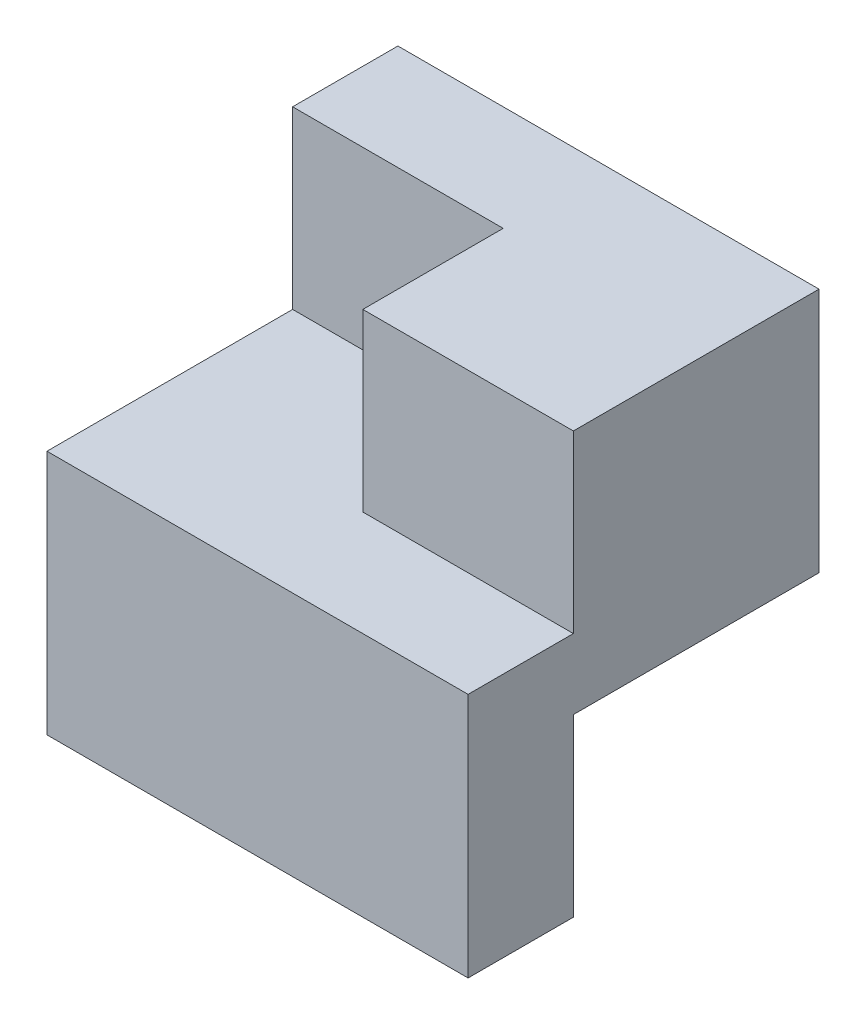
ISO-10303-21;
HEADER;
FILE_DESCRIPTION(('STEP AP214'),'2;1');
FILE_NAME('part.step','',(''),(''),'','','');
FILE_SCHEMA(('AUTOMOTIVE_DESIGN { 1 0 10303 214 1 1 1 1 }'));
ENDSEC;
DATA;
#1=APPLICATION_CONTEXT('core data for automotive mechanical design processes');
#2=APPLICATION_PROTOCOL_DEFINITION('international standard','automotive_design',2000,#1);
#3=PRODUCT_CONTEXT('',#1,'mechanical');
#4=PRODUCT('Part','Part','',(#3));
#5=PRODUCT_RELATED_PRODUCT_CATEGORY('part','',(#4));
#6=PRODUCT_DEFINITION_FORMATION('','',#4);
#7=PRODUCT_DEFINITION_CONTEXT('part definition',#1,'design');
#8=PRODUCT_DEFINITION('design','',#6,#7);
#9=PRODUCT_DEFINITION_SHAPE('','',#8);
#10=(LENGTH_UNIT() NAMED_UNIT(*) SI_UNIT(.MILLI.,.METRE.));
#11=(NAMED_UNIT(*) PLANE_ANGLE_UNIT() SI_UNIT($,.RADIAN.));
#12=(NAMED_UNIT(*) SI_UNIT($,.STERADIAN.) SOLID_ANGLE_UNIT());
#13=UNCERTAINTY_MEASURE_WITH_UNIT(LENGTH_MEASURE(1.E-05),#10,'distance_accuracy_value','');
#14=(GEOMETRIC_REPRESENTATION_CONTEXT(3) GLOBAL_UNCERTAINTY_ASSIGNED_CONTEXT((#13)) GLOBAL_UNIT_ASSIGNED_CONTEXT((#10,
#11,#12)) REPRESENTATION_CONTEXT('',''));
#15=CARTESIAN_POINT('',(0.,0.,0.));
#16=DIRECTION('',(0.,0.,1.));
#17=DIRECTION('',(1.,0.,0.));
#18=AXIS2_PLACEMENT_3D('',#15,#16,#17);
#19=CARTESIAN_POINT('',(-3.,6.,-2.5));
#20=DIRECTION('',(0.,0.,1.));
#21=DIRECTION('',(1.,0.,0.));
#22=AXIS2_PLACEMENT_3D('',#19,#20,#21);
#23=PLANE('',#22);
#24=DIRECTION('',(1.,0.,0.));
#25=VECTOR('',#24,1.);
#26=CARTESIAN_POINT('',(0.,2.5,-2.5));
#27=LINE('',#26,#25);
#28=CARTESIAN_POINT('',(-3.,2.5,-2.5));
#29=VERTEX_POINT('',#28);
#30=CARTESIAN_POINT('',(3.,2.5,-2.5));
#31=VERTEX_POINT('',#30);
#32=EDGE_CURVE('E149',#29,#31,#27,.T.);
#33=ORIENTED_EDGE('',*,*,#32,.F.);
#34=DIRECTION('',(0.,-1.,0.));
#35=VECTOR('',#34,1.);
#36=CARTESIAN_POINT('',(-3.,6.,-2.5));
#37=LINE('',#36,#35);
#38=CARTESIAN_POINT('',(-3.,6.,-2.5));
#39=VERTEX_POINT('',#38);
#40=EDGE_CURVE('E41',#39,#29,#37,.T.);
#41=ORIENTED_EDGE('',*,*,#40,.F.);
#42=DIRECTION('',(-1.,0.,0.));
#43=VECTOR('',#42,1.);
#44=CARTESIAN_POINT('',(-3.,6.,-2.5));
#45=LINE('',#44,#43);
#46=CARTESIAN_POINT('',(3.,6.,-2.5));
#47=VERTEX_POINT('',#46);
#48=EDGE_CURVE('E195',#47,#39,#45,.T.);
#49=ORIENTED_EDGE('',*,*,#48,.F.);
#50=DIRECTION('',(0.,-1.,0.));
#51=VECTOR('',#50,1.);
#52=CARTESIAN_POINT('',(3.,6.,-2.5));
#53=LINE('',#52,#51);
#54=EDGE_CURVE('E11',#47,#31,#53,.T.);
#55=ORIENTED_EDGE('',*,*,#54,.T.);
#56=EDGE_LOOP('',(#33,#41,#49,#55));
#57=FACE_BOUND('',#56,.T.);
#58=ADVANCED_FACE('F33',(#57),#23,.F.);
#59=CARTESIAN_POINT('',(-3.,6.,2.5));
#60=DIRECTION('',(0.,0.,-1.));
#61=DIRECTION('',(-1.,0.,0.));
#62=AXIS2_PLACEMENT_3D('',#59,#60,#61);
#63=PLANE('',#62);
#64=DIRECTION('',(1.,0.,0.));
#65=VECTOR('',#64,1.);
#66=CARTESIAN_POINT('',(-3.,3.5,2.5));
#67=LINE('',#66,#65);
#68=CARTESIAN_POINT('',(-3.,3.5,2.5));
#69=VERTEX_POINT('',#68);
#70=CARTESIAN_POINT('',(3.,3.5,2.5));
#71=VERTEX_POINT('',#70);
#72=EDGE_CURVE('E177',#69,#71,#67,.T.);
#73=ORIENTED_EDGE('',*,*,#72,.F.);
#74=DIRECTION('',(0.,-1.,0.));
#75=VECTOR('',#74,1.);
#76=CARTESIAN_POINT('',(-3.,6.,2.5));
#77=LINE('',#76,#75);
#78=CARTESIAN_POINT('',(-3.,0.,2.5));
#79=VERTEX_POINT('',#78);
#80=EDGE_CURVE('E209',#69,#79,#77,.T.);
#81=ORIENTED_EDGE('',*,*,#80,.T.);
#82=DIRECTION('',(1.,0.,0.));
#83=VECTOR('',#82,1.);
#84=CARTESIAN_POINT('',(-3.,0.,2.5));
#85=LINE('',#84,#83);
#86=CARTESIAN_POINT('',(3.,0.,2.5));
#87=VERTEX_POINT('',#86);
#88=EDGE_CURVE('E196',#79,#87,#85,.T.);
#89=ORIENTED_EDGE('',*,*,#88,.T.);
#90=DIRECTION('',(0.,-1.,0.));
#91=VECTOR('',#90,1.);
#92=CARTESIAN_POINT('',(3.,6.,2.5));
#93=LINE('',#92,#91);
#94=EDGE_CURVE('E201',#71,#87,#93,.T.);
#95=ORIENTED_EDGE('',*,*,#94,.F.);
#96=EDGE_LOOP('',(#73,#81,#89,#95));
#97=FACE_BOUND('',#96,.T.);
#98=ADVANCED_FACE('F236',(#97),#63,.F.);
#99=CARTESIAN_POINT('',(3.,6.,2.5));
#100=DIRECTION('',(-1.,0.,0.));
#101=DIRECTION('',(0.,0.,1.));
#102=AXIS2_PLACEMENT_3D('',#99,#100,#101);
#103=PLANE('',#102);
#104=DIRECTION('',(0.,0.,-1.));
#105=VECTOR('',#104,1.);
#106=CARTESIAN_POINT('',(3.,0.,2.5));
#107=LINE('',#106,#105);
#108=CARTESIAN_POINT('',(3.,0.,1.));
#109=VERTEX_POINT('',#108);
#110=EDGE_CURVE('E187',#87,#109,#107,.T.);
#111=ORIENTED_EDGE('',*,*,#110,.T.);
#112=DIRECTION('',(0.,-1.,0.));
#113=VECTOR('',#112,1.);
#114=CARTESIAN_POINT('',(3.,2.5,1.));
#115=LINE('',#114,#113);
#116=CARTESIAN_POINT('',(3.,2.5,1.));
#117=VERTEX_POINT('',#116);
#118=EDGE_CURVE('E159',#117,#109,#115,.T.);
#119=ORIENTED_EDGE('',*,*,#118,.F.);
#120=DIRECTION('',(0.,0.,1.));
#121=VECTOR('',#120,1.);
#122=CARTESIAN_POINT('',(3.,2.5,0.));
#123=LINE('',#122,#121);
#124=EDGE_CURVE('E151',#31,#117,#123,.T.);
#125=ORIENTED_EDGE('',*,*,#124,.F.);
#126=ORIENTED_EDGE('',*,*,#54,.F.);
#127=DIRECTION('',(0.,0.,-1.));
#128=VECTOR('',#127,1.);
#129=CARTESIAN_POINT('',(3.,6.,2.5));
#130=LINE('',#129,#128);
#131=CARTESIAN_POINT('',(3.,6.,1.));
#132=VERTEX_POINT('',#131);
#133=EDGE_CURVE('E193',#132,#47,#130,.T.);
#134=ORIENTED_EDGE('',*,*,#133,.F.);
#135=DIRECTION('',(0.,1.,0.));
#136=VECTOR('',#135,1.);
#137=CARTESIAN_POINT('',(3.,3.5,1.));
#138=LINE('',#137,#136);
#139=CARTESIAN_POINT('',(3.,3.5,1.));
#140=VERTEX_POINT('',#139);
#141=EDGE_CURVE('E56',#140,#132,#138,.T.);
#142=ORIENTED_EDGE('',*,*,#141,.F.);
#143=DIRECTION('',(0.,0.,-1.));
#144=VECTOR('',#143,1.);
#145=CARTESIAN_POINT('',(3.,3.5,2.5));
#146=LINE('',#145,#144);
#147=EDGE_CURVE('E162',#71,#140,#146,.T.);
#148=ORIENTED_EDGE('',*,*,#147,.F.);
#149=ORIENTED_EDGE('',*,*,#94,.T.);
#150=EDGE_LOOP('',(#111,#119,#125,#126,#134,#142,#148,#149));
#151=FACE_BOUND('',#150,.T.);
#152=ADVANCED_FACE('F35',(#151),#103,.F.);
#153=CARTESIAN_POINT('',(-3.,6.,2.5));
#154=DIRECTION('',(1.,0.,0.));
#155=DIRECTION('',(0.,0.,-1.));
#156=AXIS2_PLACEMENT_3D('',#153,#154,#155);
#157=PLANE('',#156);
#158=DIRECTION('',(0.,0.,-1.));
#159=VECTOR('',#158,1.);
#160=CARTESIAN_POINT('',(-3.,2.5,0.));
#161=LINE('',#160,#159);
#162=CARTESIAN_POINT('',(-3.,2.5,-1.));
#163=VERTEX_POINT('',#162);
#164=EDGE_CURVE('E138',#163,#29,#161,.T.);
#165=ORIENTED_EDGE('',*,*,#164,.F.);
#166=DIRECTION('',(0.,-1.,0.));
#167=VECTOR('',#166,1.);
#168=CARTESIAN_POINT('',(-3.,2.5,-1.));
#169=LINE('',#168,#167);
#170=CARTESIAN_POINT('',(-3.,0.,-1.));
#171=VERTEX_POINT('',#170);
#172=EDGE_CURVE('E129',#163,#171,#169,.T.);
#173=ORIENTED_EDGE('',*,*,#172,.T.);
#174=DIRECTION('',(0.,0.,1.));
#175=VECTOR('',#174,1.);
#176=CARTESIAN_POINT('',(-3.,0.,2.5));
#177=LINE('',#176,#175);
#178=EDGE_CURVE('E204',#171,#79,#177,.T.);
#179=ORIENTED_EDGE('',*,*,#178,.T.);
#180=ORIENTED_EDGE('',*,*,#80,.F.);
#181=DIRECTION('',(0.,0.,1.));
#182=VECTOR('',#181,1.);
#183=CARTESIAN_POINT('',(-3.,3.5,-1.));
#184=LINE('',#183,#182);
#185=CARTESIAN_POINT('',(-3.,3.5,-1.));
#186=VERTEX_POINT('',#185);
#187=EDGE_CURVE('E175',#186,#69,#184,.T.);
#188=ORIENTED_EDGE('',*,*,#187,.F.);
#189=DIRECTION('',(0.,1.,0.));
#190=VECTOR('',#189,1.);
#191=CARTESIAN_POINT('',(-3.,3.5,-1.));
#192=LINE('',#191,#190);
#193=CARTESIAN_POINT('',(-3.,6.,-1.));
#194=VERTEX_POINT('',#193);
#195=EDGE_CURVE('E184',#186,#194,#192,.T.);
#196=ORIENTED_EDGE('',*,*,#195,.T.);
#197=DIRECTION('',(0.,0.,1.));
#198=VECTOR('',#197,1.);
#199=CARTESIAN_POINT('',(-3.,6.,2.5));
#200=LINE('',#199,#198);
#201=EDGE_CURVE('E198',#39,#194,#200,.T.);
#202=ORIENTED_EDGE('',*,*,#201,.F.);
#203=ORIENTED_EDGE('',*,*,#40,.T.);
#204=EDGE_LOOP('',(#165,#173,#179,#180,#188,#196,#202,#203));
#205=FACE_BOUND('',#204,.T.);
#206=ADVANCED_FACE('F215',(#205),#157,.F.);
#207=CARTESIAN_POINT('',(0.,6.,0.));
#208=DIRECTION('',(0.,-1.,0.));
#209=DIRECTION('',(0.,0.,-1.));
#210=AXIS2_PLACEMENT_3D('',#207,#208,#209);
#211=PLANE('',#210);
#212=ORIENTED_EDGE('',*,*,#201,.T.);
#213=DIRECTION('',(-1.,0.,0.));
#214=VECTOR('',#213,1.);
#215=CARTESIAN_POINT('',(0.,6.,-1.));
#216=LINE('',#215,#214);
#217=CARTESIAN_POINT('',(0.,6.,-1.));
#218=VERTEX_POINT('',#217);
#219=EDGE_CURVE('E166',#218,#194,#216,.T.);
#220=ORIENTED_EDGE('',*,*,#219,.F.);
#221=DIRECTION('',(0.,0.,-1.));
#222=VECTOR('',#221,1.);
#223=CARTESIAN_POINT('',(0.,6.,1.));
#224=LINE('',#223,#222);
#225=CARTESIAN_POINT('',(0.,6.,1.));
#226=VERTEX_POINT('',#225);
#227=EDGE_CURVE('E180',#226,#218,#224,.T.);
#228=ORIENTED_EDGE('',*,*,#227,.F.);
#229=DIRECTION('',(-1.,0.,0.));
#230=VECTOR('',#229,1.);
#231=CARTESIAN_POINT('',(3.,6.,1.));
#232=LINE('',#231,#230);
#233=EDGE_CURVE('E158',#132,#226,#232,.T.);
#234=ORIENTED_EDGE('',*,*,#233,.F.);
#235=ORIENTED_EDGE('',*,*,#133,.T.);
#236=ORIENTED_EDGE('',*,*,#48,.T.);
#237=EDGE_LOOP('',(#212,#220,#228,#234,#235,#236));
#238=FACE_BOUND('',#237,.T.);
#239=ADVANCED_FACE('F242',(#238),#211,.F.);
#240=CARTESIAN_POINT('',(0.,0.,0.));
#241=DIRECTION('',(0.,-1.,0.));
#242=DIRECTION('',(0.,0.,-1.));
#243=AXIS2_PLACEMENT_3D('',#240,#241,#242);
#244=PLANE('',#243);
#245=DIRECTION('',(-1.,0.,0.));
#246=VECTOR('',#245,1.);
#247=CARTESIAN_POINT('',(0.,0.,1.));
#248=LINE('',#247,#246);
#249=CARTESIAN_POINT('',(0.,0.,1.));
#250=VERTEX_POINT('',#249);
#251=EDGE_CURVE('E142',#109,#250,#248,.T.);
#252=ORIENTED_EDGE('',*,*,#251,.F.);
#253=ORIENTED_EDGE('',*,*,#110,.F.);
#254=ORIENTED_EDGE('',*,*,#88,.F.);
#255=ORIENTED_EDGE('',*,*,#178,.F.);
#256=DIRECTION('',(-1.,0.,0.));
#257=VECTOR('',#256,1.);
#258=CARTESIAN_POINT('',(0.,0.,-1.));
#259=LINE('',#258,#257);
#260=CARTESIAN_POINT('',(0.,0.,-1.));
#261=VERTEX_POINT('',#260);
#262=EDGE_CURVE('E145',#261,#171,#259,.T.);
#263=ORIENTED_EDGE('',*,*,#262,.F.);
#264=DIRECTION('',(0.,0.,-1.));
#265=VECTOR('',#264,1.);
#266=CARTESIAN_POINT('',(0.,0.,0.));
#267=LINE('',#266,#265);
#268=EDGE_CURVE('E48',#250,#261,#267,.T.);
#269=ORIENTED_EDGE('',*,*,#268,.F.);
#270=EDGE_LOOP('',(#252,#253,#254,#255,#263,#269));
#271=FACE_BOUND('',#270,.T.);
#272=ADVANCED_FACE('F229',(#271),#244,.T.);
#273=CARTESIAN_POINT('',(0.,3.5,-1.));
#274=DIRECTION('',(0.,0.,-1.));
#275=DIRECTION('',(-1.,0.,0.));
#276=AXIS2_PLACEMENT_3D('',#273,#274,#275);
#277=PLANE('',#276);
#278=ORIENTED_EDGE('',*,*,#219,.T.);
#279=ORIENTED_EDGE('',*,*,#195,.F.);
#280=DIRECTION('',(-1.,0.,0.));
#281=VECTOR('',#280,1.);
#282=CARTESIAN_POINT('',(0.,3.5,-1.));
#283=LINE('',#282,#281);
#284=CARTESIAN_POINT('',(0.,3.5,-1.));
#285=VERTEX_POINT('',#284);
#286=EDGE_CURVE('E172',#285,#186,#283,.T.);
#287=ORIENTED_EDGE('',*,*,#286,.F.);
#288=DIRECTION('',(0.,1.,0.));
#289=VECTOR('',#288,1.);
#290=CARTESIAN_POINT('',(0.,3.5,-1.));
#291=LINE('',#290,#289);
#292=EDGE_CURVE('E188',#285,#218,#291,.T.);
#293=ORIENTED_EDGE('',*,*,#292,.T.);
#294=EDGE_LOOP('',(#278,#279,#287,#293));
#295=FACE_BOUND('',#294,.T.);
#296=ADVANCED_FACE('F251',(#295),#277,.F.);
#297=CARTESIAN_POINT('',(0.,3.5,1.));
#298=DIRECTION('',(1.,0.,0.));
#299=DIRECTION('',(0.,0.,-1.));
#300=AXIS2_PLACEMENT_3D('',#297,#298,#299);
#301=PLANE('',#300);
#302=ORIENTED_EDGE('',*,*,#227,.T.);
#303=ORIENTED_EDGE('',*,*,#292,.F.);
#304=DIRECTION('',(0.,0.,-1.));
#305=VECTOR('',#304,1.);
#306=CARTESIAN_POINT('',(0.,3.5,1.));
#307=LINE('',#306,#305);
#308=CARTESIAN_POINT('',(0.,3.5,1.));
#309=VERTEX_POINT('',#308);
#310=EDGE_CURVE('E169',#309,#285,#307,.T.);
#311=ORIENTED_EDGE('',*,*,#310,.F.);
#312=DIRECTION('',(0.,1.,0.));
#313=VECTOR('',#312,1.);
#314=CARTESIAN_POINT('',(0.,3.5,1.));
#315=LINE('',#314,#313);
#316=EDGE_CURVE('E190',#309,#226,#315,.T.);
#317=ORIENTED_EDGE('',*,*,#316,.T.);
#318=EDGE_LOOP('',(#302,#303,#311,#317));
#319=FACE_BOUND('',#318,.T.);
#320=ADVANCED_FACE('F248',(#319),#301,.F.);
#321=CARTESIAN_POINT('',(3.,3.5,1.));
#322=DIRECTION('',(0.,0.,-1.));
#323=DIRECTION('',(-1.,0.,0.));
#324=AXIS2_PLACEMENT_3D('',#321,#322,#323);
#325=PLANE('',#324);
#326=ORIENTED_EDGE('',*,*,#233,.T.);
#327=ORIENTED_EDGE('',*,*,#316,.F.);
#328=DIRECTION('',(-1.,0.,0.));
#329=VECTOR('',#328,1.);
#330=CARTESIAN_POINT('',(3.,3.5,1.));
#331=LINE('',#330,#329);
#332=EDGE_CURVE('E165',#140,#309,#331,.T.);
#333=ORIENTED_EDGE('',*,*,#332,.F.);
#334=ORIENTED_EDGE('',*,*,#141,.T.);
#335=EDGE_LOOP('',(#326,#327,#333,#334));
#336=FACE_BOUND('',#335,.T.);
#337=ADVANCED_FACE('F245',(#336),#325,.F.);
#338=CARTESIAN_POINT('',(0.,3.5,0.));
#339=DIRECTION('',(0.,1.,0.));
#340=DIRECTION('',(0.,0.,1.));
#341=AXIS2_PLACEMENT_3D('',#338,#339,#340);
#342=PLANE('',#341);
#343=ORIENTED_EDGE('',*,*,#147,.T.);
#344=ORIENTED_EDGE('',*,*,#332,.T.);
#345=ORIENTED_EDGE('',*,*,#310,.T.);
#346=ORIENTED_EDGE('',*,*,#286,.T.);
#347=ORIENTED_EDGE('',*,*,#187,.T.);
#348=ORIENTED_EDGE('',*,*,#72,.T.);
#349=EDGE_LOOP('',(#343,#344,#345,#346,#347,#348));
#350=FACE_BOUND('',#349,.T.);
#351=ADVANCED_FACE('F240',(#350),#342,.T.);
#352=CARTESIAN_POINT('',(0.,2.5,0.));
#353=DIRECTION('',(-1.,0.,0.));
#354=DIRECTION('',(0.,0.,1.));
#355=AXIS2_PLACEMENT_3D('',#352,#353,#354);
#356=PLANE('',#355);
#357=ORIENTED_EDGE('',*,*,#268,.T.);
#358=DIRECTION('',(0.,-1.,0.));
#359=VECTOR('',#358,1.);
#360=CARTESIAN_POINT('',(0.,2.5,-1.));
#361=LINE('',#360,#359);
#362=CARTESIAN_POINT('',(0.,2.5,-1.));
#363=VERTEX_POINT('',#362);
#364=EDGE_CURVE('E121',#363,#261,#361,.T.);
#365=ORIENTED_EDGE('',*,*,#364,.F.);
#366=DIRECTION('',(0.,0.,-1.));
#367=VECTOR('',#366,1.);
#368=CARTESIAN_POINT('',(0.,2.5,0.));
#369=LINE('',#368,#367);
#370=CARTESIAN_POINT('',(0.,2.5,1.));
#371=VERTEX_POINT('',#370);
#372=EDGE_CURVE('E125',#371,#363,#369,.T.);
#373=ORIENTED_EDGE('',*,*,#372,.F.);
#374=DIRECTION('',(0.,-1.,0.));
#375=VECTOR('',#374,1.);
#376=CARTESIAN_POINT('',(0.,2.5,1.));
#377=LINE('',#376,#375);
#378=EDGE_CURVE('E156',#371,#250,#377,.T.);
#379=ORIENTED_EDGE('',*,*,#378,.T.);
#380=EDGE_LOOP('',(#357,#365,#373,#379));
#381=FACE_BOUND('',#380,.T.);
#382=ADVANCED_FACE('F123',(#381),#356,.F.);
#383=CARTESIAN_POINT('',(0.,2.5,1.));
#384=DIRECTION('',(0.,0.,1.));
#385=DIRECTION('',(1.,0.,0.));
#386=AXIS2_PLACEMENT_3D('',#383,#384,#385);
#387=PLANE('',#386);
#388=ORIENTED_EDGE('',*,*,#251,.T.);
#389=ORIENTED_EDGE('',*,*,#378,.F.);
#390=DIRECTION('',(-1.,0.,0.));
#391=VECTOR('',#390,1.);
#392=CARTESIAN_POINT('',(0.,2.5,1.));
#393=LINE('',#392,#391);
#394=EDGE_CURVE('E130',#117,#371,#393,.T.);
#395=ORIENTED_EDGE('',*,*,#394,.F.);
#396=ORIENTED_EDGE('',*,*,#118,.T.);
#397=EDGE_LOOP('',(#388,#389,#395,#396));
#398=FACE_BOUND('',#397,.T.);
#399=ADVANCED_FACE('F227',(#398),#387,.F.);
#400=CARTESIAN_POINT('',(0.,2.5,-1.));
#401=DIRECTION('',(0.,0.,1.));
#402=DIRECTION('',(1.,0.,0.));
#403=AXIS2_PLACEMENT_3D('',#400,#401,#402);
#404=PLANE('',#403);
#405=ORIENTED_EDGE('',*,*,#262,.T.);
#406=ORIENTED_EDGE('',*,*,#172,.F.);
#407=DIRECTION('',(-1.,0.,0.));
#408=VECTOR('',#407,1.);
#409=CARTESIAN_POINT('',(0.,2.5,-1.));
#410=LINE('',#409,#408);
#411=EDGE_CURVE('E133',#363,#163,#410,.T.);
#412=ORIENTED_EDGE('',*,*,#411,.F.);
#413=ORIENTED_EDGE('',*,*,#364,.T.);
#414=EDGE_LOOP('',(#405,#406,#412,#413));
#415=FACE_BOUND('',#414,.T.);
#416=ADVANCED_FACE('F134',(#415),#404,.F.);
#417=CARTESIAN_POINT('',(0.,2.5,0.));
#418=DIRECTION('',(0.,-1.,0.));
#419=DIRECTION('',(0.,0.,-1.));
#420=AXIS2_PLACEMENT_3D('',#417,#418,#419);
#421=PLANE('',#420);
#422=ORIENTED_EDGE('',*,*,#372,.T.);
#423=ORIENTED_EDGE('',*,*,#411,.T.);
#424=ORIENTED_EDGE('',*,*,#164,.T.);
#425=ORIENTED_EDGE('',*,*,#32,.T.);
#426=ORIENTED_EDGE('',*,*,#124,.T.);
#427=ORIENTED_EDGE('',*,*,#394,.T.);
#428=EDGE_LOOP('',(#422,#423,#424,#425,#426,#427));
#429=FACE_BOUND('',#428,.T.);
#430=ADVANCED_FACE('F140',(#429),#421,.T.);
#431=CLOSED_SHELL('',(#58,#98,#152,#206,#239,#272,#296,#320,#337,#351,#382,#399,#416,#430));
#432=MANIFOLD_SOLID_BREP('B2',#431);
#433=ADVANCED_BREP_SHAPE_REPRESENTATION('',(#18,#432),#14);
#434=SHAPE_DEFINITION_REPRESENTATION(#9,#433);
ENDSEC;
END-ISO-10303-21;
